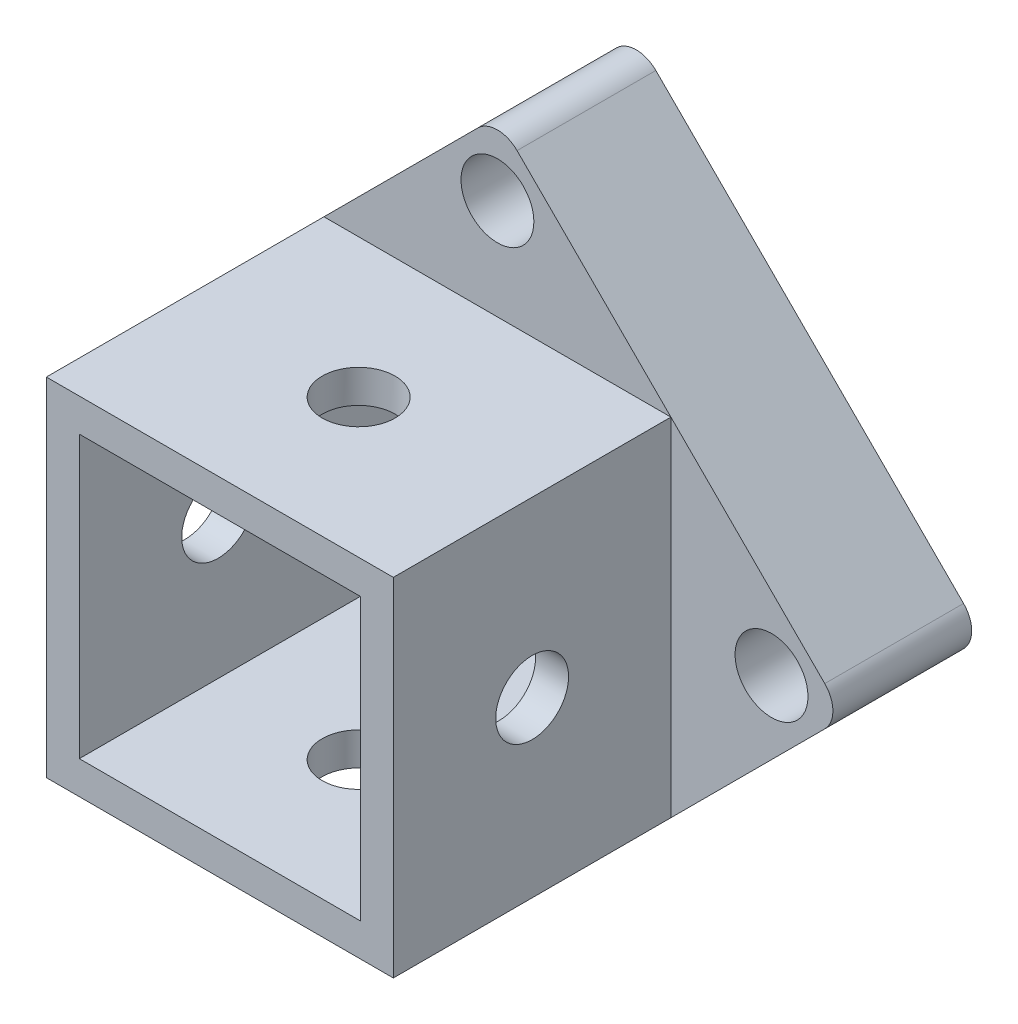
ISO-10303-21;
HEADER;
FILE_DESCRIPTION(('STEP AP214'),'2;1');
FILE_NAME('part.step','',(''),(''),'','','');
FILE_SCHEMA(('AUTOMOTIVE_DESIGN { 1 0 10303 214 1 1 1 1 }'));
ENDSEC;
DATA;
#1=APPLICATION_CONTEXT('core data for automotive mechanical design processes');
#2=APPLICATION_PROTOCOL_DEFINITION('international standard','automotive_design',2000,#1);
#3=PRODUCT_CONTEXT('',#1,'mechanical');
#4=PRODUCT('Part','Part','',(#3));
#5=PRODUCT_RELATED_PRODUCT_CATEGORY('part','',(#4));
#6=PRODUCT_DEFINITION_FORMATION('','',#4);
#7=PRODUCT_DEFINITION_CONTEXT('part definition',#1,'design');
#8=PRODUCT_DEFINITION('design','',#6,#7);
#9=PRODUCT_DEFINITION_SHAPE('','',#8);
#10=(LENGTH_UNIT() NAMED_UNIT(*) SI_UNIT(.MILLI.,.METRE.));
#11=(NAMED_UNIT(*) PLANE_ANGLE_UNIT() SI_UNIT($,.RADIAN.));
#12=(NAMED_UNIT(*) SI_UNIT($,.STERADIAN.) SOLID_ANGLE_UNIT());
#13=UNCERTAINTY_MEASURE_WITH_UNIT(LENGTH_MEASURE(1.E-05),#10,'distance_accuracy_value','');
#14=(GEOMETRIC_REPRESENTATION_CONTEXT(3) GLOBAL_UNCERTAINTY_ASSIGNED_CONTEXT((#13)) GLOBAL_UNIT_ASSIGNED_CONTEXT((#10,
#11,#12)) REPRESENTATION_CONTEXT('',''));
#15=CARTESIAN_POINT('',(0.,0.,0.));
#16=DIRECTION('',(0.,0.,1.));
#17=DIRECTION('',(1.,0.,0.));
#18=AXIS2_PLACEMENT_3D('',#15,#16,#17);
#19=CARTESIAN_POINT('',(0.,0.,5.));
#20=DIRECTION('',(0.,0.,-1.));
#21=DIRECTION('',(-1.,0.,0.));
#22=AXIS2_PLACEMENT_3D('',#19,#20,#21);
#23=PLANE('',#22);
#24=CARTESIAN_POINT('',(19.75,0.,5.));
#25=DIRECTION('',(0.,0.,1.));
#26=DIRECTION('',(1.,0.,0.));
#27=AXIS2_PLACEMENT_3D('',#24,#25,#26);
#28=CIRCLE('',#27,2.625);
#29=CARTESIAN_POINT('',(22.375,0.,5.));
#30=VERTEX_POINT('',#29);
#31=EDGE_CURVE('E259',#30,#30,#28,.T.);
#32=ORIENTED_EDGE('',*,*,#31,.F.);
#33=EDGE_LOOP('',(#32));
#34=FACE_BOUND('',#33,.T.);
#35=DIRECTION('',(0.707106781186547,0.707106781186547,0.));
#36=VECTOR('',#35,1.);
#37=CARTESIAN_POINT('',(25.,0.,5.));
#38=LINE('',#37,#36);
#39=CARTESIAN_POINT('',(12.5,-12.5,5.));
#40=VERTEX_POINT('',#39);
#41=CARTESIAN_POINT('',(23.5857864376269,-1.4142135623731,5.));
#42=VERTEX_POINT('',#41);
#43=EDGE_CURVE('E279',#40,#42,#38,.T.);
#44=ORIENTED_EDGE('',*,*,#43,.T.);
#45=CARTESIAN_POINT('',(22.1715728752538,0.,5.));
#46=DIRECTION('',(0.,0.,-1.));
#47=DIRECTION('',(-1.,0.,0.));
#48=AXIS2_PLACEMENT_3D('',#45,#46,#47);
#49=CIRCLE('',#48,2.);
#50=CARTESIAN_POINT('',(23.5857864376269,1.4142135623731,5.));
#51=VERTEX_POINT('',#50);
#52=EDGE_CURVE('E372',#42,#51,#49,.F.);
#53=ORIENTED_EDGE('',*,*,#52,.T.);
#54=DIRECTION('',(-0.707106781186547,0.707106781186547,0.));
#55=VECTOR('',#54,1.);
#56=CARTESIAN_POINT('',(0.,25.,5.));
#57=LINE('',#56,#55);
#58=CARTESIAN_POINT('',(12.5,12.5,5.));
#59=VERTEX_POINT('',#58);
#60=EDGE_CURVE('E280',#51,#59,#57,.T.);
#61=ORIENTED_EDGE('',*,*,#60,.T.);
#62=DIRECTION('',(0.,1.,0.));
#63=VECTOR('',#62,1.);
#64=CARTESIAN_POINT('',(12.5,-12.5,5.));
#65=LINE('',#64,#63);
#66=EDGE_CURVE('E197',#40,#59,#65,.T.);
#67=ORIENTED_EDGE('',*,*,#66,.F.);
#68=EDGE_LOOP('',(#44,#53,#61,#67));
#69=FACE_BOUND('',#68,.T.);
#70=ADVANCED_FACE('F45',(#34,#69),#23,.F.);
#71=CARTESIAN_POINT('',(0.,-19.7500000000001,5.));
#72=DIRECTION('',(0.,0.,1.));
#73=DIRECTION('',(1.,0.,0.));
#74=AXIS2_PLACEMENT_3D('',#71,#72,#73);
#75=CIRCLE('',#74,2.62500000000005);
#76=CARTESIAN_POINT('',(2.62499999999999,-19.7500000000001,5.));
#77=VERTEX_POINT('',#76);
#78=EDGE_CURVE('E251',#77,#77,#75,.T.);
#79=ORIENTED_EDGE('',*,*,#78,.F.);
#80=EDGE_LOOP('',(#79));
#81=FACE_BOUND('',#80,.T.);
#82=DIRECTION('',(0.707106781186547,-0.707106781186547,0.));
#83=VECTOR('',#82,1.);
#84=CARTESIAN_POINT('',(0.,-25.,5.));
#85=LINE('',#84,#83);
#86=CARTESIAN_POINT('',(-12.5,-12.5,5.));
#87=VERTEX_POINT('',#86);
#88=CARTESIAN_POINT('',(-1.41421356237309,-23.5857864376269,5.));
#89=VERTEX_POINT('',#88);
#90=EDGE_CURVE('E287',#87,#89,#85,.T.);
#91=ORIENTED_EDGE('',*,*,#90,.T.);
#92=CARTESIAN_POINT('',(0.,-22.1715728752538,5.));
#93=DIRECTION('',(0.,0.,-1.));
#94=DIRECTION('',(-1.,0.,0.));
#95=AXIS2_PLACEMENT_3D('',#92,#93,#94);
#96=CIRCLE('',#95,2.);
#97=CARTESIAN_POINT('',(1.4142135623731,-23.5857864376269,5.));
#98=VERTEX_POINT('',#97);
#99=EDGE_CURVE('E362',#89,#98,#96,.F.);
#100=ORIENTED_EDGE('',*,*,#99,.T.);
#101=EDGE_CURVE('E275',#98,#40,#38,.T.);
#102=ORIENTED_EDGE('',*,*,#101,.T.);
#103=DIRECTION('',(1.,0.,0.));
#104=VECTOR('',#103,1.);
#105=CARTESIAN_POINT('',(-12.5,-12.5,5.));
#106=LINE('',#105,#104);
#107=EDGE_CURVE('E203',#87,#40,#106,.T.);
#108=ORIENTED_EDGE('',*,*,#107,.F.);
#109=EDGE_LOOP('',(#91,#100,#102,#108));
#110=FACE_BOUND('',#109,.T.);
#111=ADVANCED_FACE('F430',(#81,#110),#23,.F.);
#112=CARTESIAN_POINT('',(-19.7500000000001,0.,5.));
#113=DIRECTION('',(0.,0.,1.));
#114=DIRECTION('',(1.,0.,0.));
#115=AXIS2_PLACEMENT_3D('',#112,#113,#114);
#116=CIRCLE('',#115,2.62500000000019);
#117=CARTESIAN_POINT('',(-17.1249999999999,0.,5.));
#118=VERTEX_POINT('',#117);
#119=EDGE_CURVE('E243',#118,#118,#116,.T.);
#120=ORIENTED_EDGE('',*,*,#119,.F.);
#121=EDGE_LOOP('',(#120));
#122=FACE_BOUND('',#121,.T.);
#123=DIRECTION('',(-0.707106781186547,-0.707106781186547,0.));
#124=VECTOR('',#123,1.);
#125=CARTESIAN_POINT('',(-25.,0.,5.));
#126=LINE('',#125,#124);
#127=CARTESIAN_POINT('',(-12.5,12.5,5.));
#128=VERTEX_POINT('',#127);
#129=CARTESIAN_POINT('',(-23.5857864376269,1.4142135623731,5.));
#130=VERTEX_POINT('',#129);
#131=EDGE_CURVE('E283',#128,#130,#126,.T.);
#132=ORIENTED_EDGE('',*,*,#131,.T.);
#133=CARTESIAN_POINT('',(-22.1715728752538,0.,5.));
#134=DIRECTION('',(0.,0.,-1.));
#135=DIRECTION('',(-1.,0.,0.));
#136=AXIS2_PLACEMENT_3D('',#133,#134,#135);
#137=CIRCLE('',#136,2.);
#138=CARTESIAN_POINT('',(-23.5857864376269,-1.4142135623731,5.));
#139=VERTEX_POINT('',#138);
#140=EDGE_CURVE('E11',#130,#139,#137,.F.);
#141=ORIENTED_EDGE('',*,*,#140,.T.);
#142=EDGE_CURVE('E288',#139,#87,#85,.T.);
#143=ORIENTED_EDGE('',*,*,#142,.T.);
#144=DIRECTION('',(0.,-1.,0.));
#145=VECTOR('',#144,1.);
#146=CARTESIAN_POINT('',(-12.5,-12.5,5.));
#147=LINE('',#146,#145);
#148=EDGE_CURVE('E220',#128,#87,#147,.T.);
#149=ORIENTED_EDGE('',*,*,#148,.F.);
#150=EDGE_LOOP('',(#132,#141,#143,#149));
#151=FACE_BOUND('',#150,.T.);
#152=ADVANCED_FACE('F441',(#122,#151),#23,.F.);
#153=CARTESIAN_POINT('',(0.,19.75,5.));
#154=DIRECTION('',(0.,0.,1.));
#155=DIRECTION('',(1.,0.,0.));
#156=AXIS2_PLACEMENT_3D('',#153,#154,#155);
#157=CIRCLE('',#156,2.625);
#158=CARTESIAN_POINT('',(2.625,19.75,5.));
#159=VERTEX_POINT('',#158);
#160=EDGE_CURVE('E267',#159,#159,#157,.T.);
#161=ORIENTED_EDGE('',*,*,#160,.F.);
#162=EDGE_LOOP('',(#161));
#163=FACE_BOUND('',#162,.T.);
#164=CARTESIAN_POINT('',(1.41421356237309,23.5857864376269,5.));
#165=VERTEX_POINT('',#164);
#166=EDGE_CURVE('E278',#59,#165,#57,.T.);
#167=ORIENTED_EDGE('',*,*,#166,.T.);
#168=CARTESIAN_POINT('',(0.,22.1715728752538,5.));
#169=DIRECTION('',(0.,0.,-1.));
#170=DIRECTION('',(-1.,0.,0.));
#171=AXIS2_PLACEMENT_3D('',#168,#169,#170);
#172=CIRCLE('',#171,2.);
#173=CARTESIAN_POINT('',(-1.4142135623731,23.5857864376269,5.));
#174=VERTEX_POINT('',#173);
#175=EDGE_CURVE('E54',#165,#174,#172,.F.);
#176=ORIENTED_EDGE('',*,*,#175,.T.);
#177=EDGE_CURVE('E284',#174,#128,#126,.T.);
#178=ORIENTED_EDGE('',*,*,#177,.T.);
#179=DIRECTION('',(-1.,0.,0.));
#180=VECTOR('',#179,1.);
#181=CARTESIAN_POINT('',(-12.5,12.5,5.));
#182=LINE('',#181,#180);
#183=EDGE_CURVE('E216',#59,#128,#182,.T.);
#184=ORIENTED_EDGE('',*,*,#183,.F.);
#185=EDGE_LOOP('',(#167,#176,#178,#184));
#186=FACE_BOUND('',#185,.T.);
#187=ADVANCED_FACE('F414',(#163,#186),#23,.F.);
#188=CARTESIAN_POINT('',(0.,0.,-5.));
#189=DIRECTION('',(0.,0.,-1.));
#190=DIRECTION('',(-1.,0.,0.));
#191=AXIS2_PLACEMENT_3D('',#188,#189,#190);
#192=PLANE('',#191);
#193=DIRECTION('',(0.707106781186547,0.707106781186547,0.));
#194=VECTOR('',#193,1.);
#195=CARTESIAN_POINT('',(25.,0.,-5.));
#196=LINE('',#195,#194);
#197=CARTESIAN_POINT('',(1.4142135623731,-23.5857864376269,-5.));
#198=VERTEX_POINT('',#197);
#199=CARTESIAN_POINT('',(23.5857864376269,-1.4142135623731,-5.));
#200=VERTEX_POINT('',#199);
#201=EDGE_CURVE('E271',#198,#200,#196,.T.);
#202=ORIENTED_EDGE('',*,*,#201,.F.);
#203=CARTESIAN_POINT('',(0.,-22.1715728752538,-5.));
#204=DIRECTION('',(0.,0.,-1.));
#205=DIRECTION('',(-1.,0.,0.));
#206=AXIS2_PLACEMENT_3D('',#203,#204,#205);
#207=CIRCLE('',#206,2.);
#208=CARTESIAN_POINT('',(-1.41421356237309,-23.5857864376269,-5.));
#209=VERTEX_POINT('',#208);
#210=EDGE_CURVE('E352',#198,#209,#207,.T.);
#211=ORIENTED_EDGE('',*,*,#210,.T.);
#212=DIRECTION('',(0.707106781186547,-0.707106781186547,0.));
#213=VECTOR('',#212,1.);
#214=CARTESIAN_POINT('',(0.,-25.,-5.));
#215=LINE('',#214,#213);
#216=CARTESIAN_POINT('',(-23.5857864376269,-1.4142135623731,-5.));
#217=VERTEX_POINT('',#216);
#218=EDGE_CURVE('E302',#217,#209,#215,.T.);
#219=ORIENTED_EDGE('',*,*,#218,.F.);
#220=CARTESIAN_POINT('',(-22.1715728752538,0.,-5.));
#221=DIRECTION('',(0.,0.,-1.));
#222=DIRECTION('',(-1.,0.,0.));
#223=AXIS2_PLACEMENT_3D('',#220,#221,#222);
#224=CIRCLE('',#223,2.);
#225=CARTESIAN_POINT('',(-23.5857864376269,1.4142135623731,-5.));
#226=VERTEX_POINT('',#225);
#227=EDGE_CURVE('E343',#217,#226,#224,.T.);
#228=ORIENTED_EDGE('',*,*,#227,.T.);
#229=DIRECTION('',(-0.707106781186547,-0.707106781186547,0.));
#230=VECTOR('',#229,1.);
#231=CARTESIAN_POINT('',(-25.,0.,-5.));
#232=LINE('',#231,#230);
#233=CARTESIAN_POINT('',(-1.4142135623731,23.5857864376269,-5.));
#234=VERTEX_POINT('',#233);
#235=EDGE_CURVE('E299',#234,#226,#232,.T.);
#236=ORIENTED_EDGE('',*,*,#235,.F.);
#237=CARTESIAN_POINT('',(0.,22.1715728752538,-5.));
#238=DIRECTION('',(0.,0.,-1.));
#239=DIRECTION('',(-1.,0.,0.));
#240=AXIS2_PLACEMENT_3D('',#237,#238,#239);
#241=CIRCLE('',#240,2.);
#242=CARTESIAN_POINT('',(1.41421356237309,23.5857864376269,-5.));
#243=VERTEX_POINT('',#242);
#244=EDGE_CURVE('E346',#234,#243,#241,.T.);
#245=ORIENTED_EDGE('',*,*,#244,.T.);
#246=DIRECTION('',(-0.707106781186547,0.707106781186547,0.));
#247=VECTOR('',#246,1.);
#248=CARTESIAN_POINT('',(0.,25.,-5.));
#249=LINE('',#248,#247);
#250=CARTESIAN_POINT('',(23.5857864376269,1.4142135623731,-5.));
#251=VERTEX_POINT('',#250);
#252=EDGE_CURVE('E295',#251,#243,#249,.T.);
#253=ORIENTED_EDGE('',*,*,#252,.F.);
#254=CARTESIAN_POINT('',(22.1715728752538,0.,-5.));
#255=DIRECTION('',(0.,0.,-1.));
#256=DIRECTION('',(-1.,0.,0.));
#257=AXIS2_PLACEMENT_3D('',#254,#255,#256);
#258=CIRCLE('',#257,2.);
#259=EDGE_CURVE('E349',#251,#200,#258,.T.);
#260=ORIENTED_EDGE('',*,*,#259,.T.);
#261=EDGE_LOOP('',(#202,#211,#219,#228,#236,#245,#253,#260));
#262=FACE_BOUND('',#261,.T.);
#263=DIRECTION('',(1.,0.,0.));
#264=VECTOR('',#263,1.);
#265=CARTESIAN_POINT('',(-10.125,-10.125,-5.));
#266=LINE('',#265,#264);
#267=CARTESIAN_POINT('',(-10.125,-10.125,-5.));
#268=VERTEX_POINT('',#267);
#269=CARTESIAN_POINT('',(10.125,-10.125,-5.));
#270=VERTEX_POINT('',#269);
#271=EDGE_CURVE('E314',#268,#270,#266,.T.);
#272=ORIENTED_EDGE('',*,*,#271,.T.);
#273=DIRECTION('',(0.,1.,0.));
#274=VECTOR('',#273,1.);
#275=CARTESIAN_POINT('',(10.125,-10.125,-5.));
#276=LINE('',#275,#274);
#277=CARTESIAN_POINT('',(10.125,10.125,-5.));
#278=VERTEX_POINT('',#277);
#279=EDGE_CURVE('E291',#270,#278,#276,.T.);
#280=ORIENTED_EDGE('',*,*,#279,.T.);
#281=DIRECTION('',(-1.,0.,0.));
#282=VECTOR('',#281,1.);
#283=CARTESIAN_POINT('',(-10.125,10.125,-5.));
#284=LINE('',#283,#282);
#285=CARTESIAN_POINT('',(-10.125,10.125,-5.));
#286=VERTEX_POINT('',#285);
#287=EDGE_CURVE('E167',#278,#286,#284,.T.);
#288=ORIENTED_EDGE('',*,*,#287,.T.);
#289=DIRECTION('',(0.,-1.,0.));
#290=VECTOR('',#289,1.);
#291=CARTESIAN_POINT('',(-10.125,-10.125,-5.));
#292=LINE('',#291,#290);
#293=EDGE_CURVE('E310',#286,#268,#292,.T.);
#294=ORIENTED_EDGE('',*,*,#293,.T.);
#295=EDGE_LOOP('',(#272,#280,#288,#294));
#296=FACE_BOUND('',#295,.T.);
#297=CARTESIAN_POINT('',(0.,-19.7500000000001,-5.));
#298=DIRECTION('',(0.,0.,1.));
#299=DIRECTION('',(1.,0.,0.));
#300=AXIS2_PLACEMENT_3D('',#297,#298,#299);
#301=CIRCLE('',#300,2.62500000000005);
#302=CARTESIAN_POINT('',(2.62499999999999,-19.7500000000001,-5.));
#303=VERTEX_POINT('',#302);
#304=EDGE_CURVE('E247',#303,#303,#301,.T.);
#305=ORIENTED_EDGE('',*,*,#304,.T.);
#306=EDGE_LOOP('',(#305));
#307=FACE_BOUND('',#306,.T.);
#308=CARTESIAN_POINT('',(-19.7500000000001,0.,-5.));
#309=DIRECTION('',(0.,0.,1.));
#310=DIRECTION('',(1.,0.,0.));
#311=AXIS2_PLACEMENT_3D('',#308,#309,#310);
#312=CIRCLE('',#311,2.62500000000019);
#313=CARTESIAN_POINT('',(-17.1249999999999,0.,-5.));
#314=VERTEX_POINT('',#313);
#315=EDGE_CURVE('E242',#314,#314,#312,.T.);
#316=ORIENTED_EDGE('',*,*,#315,.T.);
#317=EDGE_LOOP('',(#316));
#318=FACE_BOUND('',#317,.T.);
#319=CARTESIAN_POINT('',(0.,19.75,-5.));
#320=DIRECTION('',(0.,0.,1.));
#321=DIRECTION('',(1.,0.,0.));
#322=AXIS2_PLACEMENT_3D('',#319,#320,#321);
#323=CIRCLE('',#322,2.625);
#324=CARTESIAN_POINT('',(2.625,19.75,-5.));
#325=VERTEX_POINT('',#324);
#326=EDGE_CURVE('E263',#325,#325,#323,.T.);
#327=ORIENTED_EDGE('',*,*,#326,.T.);
#328=EDGE_LOOP('',(#327));
#329=FACE_BOUND('',#328,.T.);
#330=CARTESIAN_POINT('',(19.75,0.,-5.));
#331=DIRECTION('',(0.,0.,1.));
#332=DIRECTION('',(1.,0.,0.));
#333=AXIS2_PLACEMENT_3D('',#330,#331,#332);
#334=CIRCLE('',#333,2.625);
#335=CARTESIAN_POINT('',(22.375,0.,-5.));
#336=VERTEX_POINT('',#335);
#337=EDGE_CURVE('E255',#336,#336,#334,.T.);
#338=ORIENTED_EDGE('',*,*,#337,.T.);
#339=EDGE_LOOP('',(#338));
#340=FACE_BOUND('',#339,.T.);
#341=ADVANCED_FACE('F405',(#262,#296,#307,#318,#329,#340),#192,.T.);
#342=CARTESIAN_POINT('',(10.125,-10.125,5.));
#343=DIRECTION('',(-1.,0.,0.));
#344=DIRECTION('',(0.,0.,1.));
#345=AXIS2_PLACEMENT_3D('',#342,#343,#344);
#346=PLANE('',#345);
#347=CARTESIAN_POINT('',(10.125,0.,15.));
#348=DIRECTION('',(-1.,0.,0.));
#349=DIRECTION('',(0.,0.,1.));
#350=AXIS2_PLACEMENT_3D('',#347,#348,#349);
#351=CIRCLE('',#350,2.625);
#352=CARTESIAN_POINT('',(10.125,0.,17.625));
#353=VERTEX_POINT('',#352);
#354=EDGE_CURVE('E522',#353,#353,#351,.T.);
#355=ORIENTED_EDGE('',*,*,#354,.F.);
#356=EDGE_LOOP('',(#355));
#357=FACE_BOUND('',#356,.T.);
#358=ORIENTED_EDGE('',*,*,#279,.F.);
#359=DIRECTION('',(0.,0.,-1.));
#360=VECTOR('',#359,1.);
#361=CARTESIAN_POINT('',(10.125,-10.125,5.));
#362=LINE('',#361,#360);
#363=CARTESIAN_POINT('',(10.125,-10.125,25.));
#364=VERTEX_POINT('',#363);
#365=EDGE_CURVE('E178',#364,#270,#362,.T.);
#366=ORIENTED_EDGE('',*,*,#365,.F.);
#367=DIRECTION('',(0.,1.,0.));
#368=VECTOR('',#367,1.);
#369=CARTESIAN_POINT('',(10.125,-10.125,25.));
#370=LINE('',#369,#368);
#371=CARTESIAN_POINT('',(10.125,10.125,25.));
#372=VERTEX_POINT('',#371);
#373=EDGE_CURVE('E175',#364,#372,#370,.T.);
#374=ORIENTED_EDGE('',*,*,#373,.T.);
#375=DIRECTION('',(0.,0.,-1.));
#376=VECTOR('',#375,1.);
#377=CARTESIAN_POINT('',(10.125,10.125,5.));
#378=LINE('',#377,#376);
#379=EDGE_CURVE('E160',#372,#278,#378,.T.);
#380=ORIENTED_EDGE('',*,*,#379,.T.);
#381=EDGE_LOOP('',(#358,#366,#374,#380));
#382=FACE_BOUND('',#381,.T.);
#383=ADVANCED_FACE('F176',(#357,#382),#346,.T.);
#384=CARTESIAN_POINT('',(-10.125,10.125,5.));
#385=DIRECTION('',(0.,-1.,0.));
#386=DIRECTION('',(0.,0.,-1.));
#387=AXIS2_PLACEMENT_3D('',#384,#385,#386);
#388=PLANE('',#387);
#389=CARTESIAN_POINT('',(0.,10.125,15.));
#390=DIRECTION('',(0.,-1.,0.));
#391=DIRECTION('',(0.,0.,-1.));
#392=AXIS2_PLACEMENT_3D('',#389,#390,#391);
#393=CIRCLE('',#392,2.625);
#394=CARTESIAN_POINT('',(0.,10.125,12.375));
#395=VERTEX_POINT('',#394);
#396=EDGE_CURVE('E183',#395,#395,#393,.T.);
#397=ORIENTED_EDGE('',*,*,#396,.F.);
#398=EDGE_LOOP('',(#397));
#399=FACE_BOUND('',#398,.T.);
#400=ORIENTED_EDGE('',*,*,#287,.F.);
#401=ORIENTED_EDGE('',*,*,#379,.F.);
#402=DIRECTION('',(-1.,0.,0.));
#403=VECTOR('',#402,1.);
#404=CARTESIAN_POINT('',(-10.125,10.125,25.));
#405=LINE('',#404,#403);
#406=CARTESIAN_POINT('',(-10.125,10.125,25.));
#407=VERTEX_POINT('',#406);
#408=EDGE_CURVE('E164',#372,#407,#405,.T.);
#409=ORIENTED_EDGE('',*,*,#408,.T.);
#410=DIRECTION('',(0.,0.,-1.));
#411=VECTOR('',#410,1.);
#412=CARTESIAN_POINT('',(-10.125,10.125,5.));
#413=LINE('',#412,#411);
#414=EDGE_CURVE('E172',#407,#286,#413,.T.);
#415=ORIENTED_EDGE('',*,*,#414,.T.);
#416=EDGE_LOOP('',(#400,#401,#409,#415));
#417=FACE_BOUND('',#416,.T.);
#418=ADVANCED_FACE('F162',(#399,#417),#388,.T.);
#419=CARTESIAN_POINT('',(-10.125,-10.125,5.));
#420=DIRECTION('',(1.,0.,0.));
#421=DIRECTION('',(0.,0.,-1.));
#422=AXIS2_PLACEMENT_3D('',#419,#420,#421);
#423=PLANE('',#422);
#424=CARTESIAN_POINT('',(-10.125,0.,15.));
#425=DIRECTION('',(1.,0.,0.));
#426=DIRECTION('',(0.,0.,-1.));
#427=AXIS2_PLACEMENT_3D('',#424,#425,#426);
#428=CIRCLE('',#427,2.625);
#429=CARTESIAN_POINT('',(-10.125,0.,12.375));
#430=VERTEX_POINT('',#429);
#431=EDGE_CURVE('E335',#430,#430,#428,.T.);
#432=ORIENTED_EDGE('',*,*,#431,.F.);
#433=EDGE_LOOP('',(#432));
#434=FACE_BOUND('',#433,.T.);
#435=ORIENTED_EDGE('',*,*,#293,.F.);
#436=ORIENTED_EDGE('',*,*,#414,.F.);
#437=DIRECTION('',(0.,-1.,0.));
#438=VECTOR('',#437,1.);
#439=CARTESIAN_POINT('',(-10.125,-10.125,25.));
#440=LINE('',#439,#438);
#441=CARTESIAN_POINT('',(-10.125,-10.125,25.));
#442=VERTEX_POINT('',#441);
#443=EDGE_CURVE('E187',#407,#442,#440,.T.);
#444=ORIENTED_EDGE('',*,*,#443,.T.);
#445=DIRECTION('',(0.,0.,-1.));
#446=VECTOR('',#445,1.);
#447=CARTESIAN_POINT('',(-10.125,-10.125,5.));
#448=LINE('',#447,#446);
#449=EDGE_CURVE('E320',#442,#268,#448,.T.);
#450=ORIENTED_EDGE('',*,*,#449,.T.);
#451=EDGE_LOOP('',(#435,#436,#444,#450));
#452=FACE_BOUND('',#451,.T.);
#453=ADVANCED_FACE('F504',(#434,#452),#423,.T.);
#454=CARTESIAN_POINT('',(-10.125,-10.125,5.));
#455=DIRECTION('',(0.,1.,0.));
#456=DIRECTION('',(0.,0.,1.));
#457=AXIS2_PLACEMENT_3D('',#454,#455,#456);
#458=PLANE('',#457);
#459=CARTESIAN_POINT('',(0.,-10.125,15.));
#460=DIRECTION('',(0.,1.,0.));
#461=DIRECTION('',(0.,0.,1.));
#462=AXIS2_PLACEMENT_3D('',#459,#460,#461);
#463=CIRCLE('',#462,2.625);
#464=CARTESIAN_POINT('',(0.,-10.125,17.625));
#465=VERTEX_POINT('',#464);
#466=EDGE_CURVE('E329',#465,#465,#463,.T.);
#467=ORIENTED_EDGE('',*,*,#466,.F.);
#468=EDGE_LOOP('',(#467));
#469=FACE_BOUND('',#468,.T.);
#470=ORIENTED_EDGE('',*,*,#271,.F.);
#471=ORIENTED_EDGE('',*,*,#449,.F.);
#472=DIRECTION('',(1.,0.,0.));
#473=VECTOR('',#472,1.);
#474=CARTESIAN_POINT('',(-10.125,-10.125,25.));
#475=LINE('',#474,#473);
#476=EDGE_CURVE('E191',#442,#364,#475,.T.);
#477=ORIENTED_EDGE('',*,*,#476,.T.);
#478=ORIENTED_EDGE('',*,*,#365,.T.);
#479=EDGE_LOOP('',(#470,#471,#477,#478));
#480=FACE_BOUND('',#479,.T.);
#481=ADVANCED_FACE('F500',(#469,#480),#458,.T.);
#482=CARTESIAN_POINT('',(0.,25.,5.));
#483=DIRECTION('',(-0.707106781186548,-0.707106781186548,0.));
#484=DIRECTION('',(0.707106781186548,-0.707106781186548,0.));
#485=AXIS2_PLACEMENT_3D('',#482,#483,#484);
#486=PLANE('',#485);
#487=ORIENTED_EDGE('',*,*,#60,.F.);
#488=DIRECTION('',(0.,0.,-1.));
#489=VECTOR('',#488,1.);
#490=CARTESIAN_POINT('',(23.5857864376269,1.4142135623731,5.));
#491=LINE('',#490,#489);
#492=EDGE_CURVE('E368',#51,#251,#491,.T.);
#493=ORIENTED_EDGE('',*,*,#492,.T.);
#494=ORIENTED_EDGE('',*,*,#252,.T.);
#495=DIRECTION('',(0.,0.,-1.));
#496=VECTOR('',#495,1.);
#497=CARTESIAN_POINT('',(1.41421356237309,23.5857864376269,5.));
#498=LINE('',#497,#496);
#499=EDGE_CURVE('E365',#243,#165,#498,.F.);
#500=ORIENTED_EDGE('',*,*,#499,.T.);
#501=ORIENTED_EDGE('',*,*,#166,.F.);
#502=EDGE_LOOP('',(#487,#493,#494,#500,#501));
#503=FACE_BOUND('',#502,.T.);
#504=ADVANCED_FACE('F400',(#503),#486,.F.);
#505=CARTESIAN_POINT('',(-25.,0.,5.));
#506=DIRECTION('',(0.707106781186548,-0.707106781186548,0.));
#507=DIRECTION('',(0.707106781186548,0.707106781186548,0.));
#508=AXIS2_PLACEMENT_3D('',#505,#506,#507);
#509=PLANE('',#508);
#510=ORIENTED_EDGE('',*,*,#177,.F.);
#511=DIRECTION('',(0.,0.,-1.));
#512=VECTOR('',#511,1.);
#513=CARTESIAN_POINT('',(-1.41421356237309,23.5857864376269,5.));
#514=LINE('',#513,#512);
#515=EDGE_CURVE('E377',#174,#234,#514,.T.);
#516=ORIENTED_EDGE('',*,*,#515,.T.);
#517=ORIENTED_EDGE('',*,*,#235,.T.);
#518=DIRECTION('',(0.,0.,-1.));
#519=VECTOR('',#518,1.);
#520=CARTESIAN_POINT('',(-23.5857864376269,1.4142135623731,5.));
#521=LINE('',#520,#519);
#522=EDGE_CURVE('E68',#226,#130,#521,.F.);
#523=ORIENTED_EDGE('',*,*,#522,.T.);
#524=ORIENTED_EDGE('',*,*,#131,.F.);
#525=EDGE_LOOP('',(#510,#516,#517,#523,#524));
#526=FACE_BOUND('',#525,.T.);
#527=ADVANCED_FACE('F411',(#526),#509,.F.);
#528=CARTESIAN_POINT('',(25.,0.,5.));
#529=DIRECTION('',(-0.707106781186548,0.707106781186548,0.));
#530=DIRECTION('',(-0.707106781186548,-0.707106781186548,0.));
#531=AXIS2_PLACEMENT_3D('',#528,#529,#530);
#532=PLANE('',#531);
#533=ORIENTED_EDGE('',*,*,#101,.F.);
#534=DIRECTION('',(0.,0.,-1.));
#535=VECTOR('',#534,1.);
#536=CARTESIAN_POINT('',(1.41421356237309,-23.5857864376269,5.));
#537=LINE('',#536,#535);
#538=EDGE_CURVE('E339',#98,#198,#537,.T.);
#539=ORIENTED_EDGE('',*,*,#538,.T.);
#540=ORIENTED_EDGE('',*,*,#201,.T.);
#541=DIRECTION('',(0.,0.,-1.));
#542=VECTOR('',#541,1.);
#543=CARTESIAN_POINT('',(23.5857864376269,-1.4142135623731,5.));
#544=LINE('',#543,#542);
#545=EDGE_CURVE('E171',#200,#42,#544,.F.);
#546=ORIENTED_EDGE('',*,*,#545,.T.);
#547=ORIENTED_EDGE('',*,*,#43,.F.);
#548=EDGE_LOOP('',(#533,#539,#540,#546,#547));
#549=FACE_BOUND('',#548,.T.);
#550=ADVANCED_FACE('F448',(#549),#532,.F.);
#551=CARTESIAN_POINT('',(0.,-25.,5.));
#552=DIRECTION('',(0.707106781186548,0.707106781186548,0.));
#553=DIRECTION('',(-0.707106781186548,0.707106781186548,0.));
#554=AXIS2_PLACEMENT_3D('',#551,#552,#553);
#555=PLANE('',#554);
#556=ORIENTED_EDGE('',*,*,#218,.T.);
#557=DIRECTION('',(0.,0.,-1.));
#558=VECTOR('',#557,1.);
#559=CARTESIAN_POINT('',(-1.41421356237309,-23.5857864376269,5.));
#560=LINE('',#559,#558);
#561=EDGE_CURVE('E359',#209,#89,#560,.F.);
#562=ORIENTED_EDGE('',*,*,#561,.T.);
#563=ORIENTED_EDGE('',*,*,#90,.F.);
#564=ORIENTED_EDGE('',*,*,#142,.F.);
#565=DIRECTION('',(0.,0.,-1.));
#566=VECTOR('',#565,1.);
#567=CARTESIAN_POINT('',(-23.5857864376269,-1.4142135623731,5.));
#568=LINE('',#567,#566);
#569=EDGE_CURVE('E355',#139,#217,#568,.T.);
#570=ORIENTED_EDGE('',*,*,#569,.T.);
#571=EDGE_LOOP('',(#556,#562,#563,#564,#570));
#572=FACE_BOUND('',#571,.T.);
#573=ADVANCED_FACE('F434',(#572),#555,.F.);
#574=CARTESIAN_POINT('',(0.,19.75,5.));
#575=DIRECTION('',(0.,0.,-1.));
#576=DIRECTION('',(-1.,0.,0.));
#577=AXIS2_PLACEMENT_3D('',#574,#575,#576);
#578=CYLINDRICAL_SURFACE('',#577,2.625);
#579=ORIENTED_EDGE('',*,*,#160,.T.);
#580=EDGE_LOOP('',(#579));
#581=FACE_BOUND('',#580,.T.);
#582=ORIENTED_EDGE('',*,*,#326,.F.);
#583=EDGE_LOOP('',(#582));
#584=FACE_BOUND('',#583,.T.);
#585=ADVANCED_FACE('F455',(#581,#584),#578,.F.);
#586=CARTESIAN_POINT('',(19.75,0.,5.));
#587=DIRECTION('',(0.,0.,-1.));
#588=DIRECTION('',(-1.,0.,0.));
#589=AXIS2_PLACEMENT_3D('',#586,#587,#588);
#590=CYLINDRICAL_SURFACE('',#589,2.625);
#591=ORIENTED_EDGE('',*,*,#31,.T.);
#592=EDGE_LOOP('',(#591));
#593=FACE_BOUND('',#592,.T.);
#594=ORIENTED_EDGE('',*,*,#337,.F.);
#595=EDGE_LOOP('',(#594));
#596=FACE_BOUND('',#595,.T.);
#597=ADVANCED_FACE('F481',(#593,#596),#590,.F.);
#598=CARTESIAN_POINT('',(0.,-19.7500000000001,5.));
#599=DIRECTION('',(0.,0.,-1.));
#600=DIRECTION('',(-1.,0.,0.));
#601=AXIS2_PLACEMENT_3D('',#598,#599,#600);
#602=CYLINDRICAL_SURFACE('',#601,2.62500000000005);
#603=ORIENTED_EDGE('',*,*,#78,.T.);
#604=EDGE_LOOP('',(#603));
#605=FACE_BOUND('',#604,.T.);
#606=ORIENTED_EDGE('',*,*,#304,.F.);
#607=EDGE_LOOP('',(#606));
#608=FACE_BOUND('',#607,.T.);
#609=ADVANCED_FACE('F489',(#605,#608),#602,.F.);
#610=CARTESIAN_POINT('',(-19.7500000000001,0.,5.));
#611=DIRECTION('',(0.,0.,-1.));
#612=DIRECTION('',(-1.,0.,0.));
#613=AXIS2_PLACEMENT_3D('',#610,#611,#612);
#614=CYLINDRICAL_SURFACE('',#613,2.62500000000019);
#615=ORIENTED_EDGE('',*,*,#119,.T.);
#616=EDGE_LOOP('',(#615));
#617=FACE_BOUND('',#616,.T.);
#618=ORIENTED_EDGE('',*,*,#315,.F.);
#619=EDGE_LOOP('',(#618));
#620=FACE_BOUND('',#619,.T.);
#621=ADVANCED_FACE('F495',(#617,#620),#614,.F.);
#622=CARTESIAN_POINT('',(0.,0.,25.));
#623=DIRECTION('',(0.,0.,-1.));
#624=DIRECTION('',(-1.,0.,0.));
#625=AXIS2_PLACEMENT_3D('',#622,#623,#624);
#626=PLANE('',#625);
#627=DIRECTION('',(0.,1.,0.));
#628=VECTOR('',#627,1.);
#629=CARTESIAN_POINT('',(12.5,-12.5,25.));
#630=LINE('',#629,#628);
#631=CARTESIAN_POINT('',(12.5,-12.5,25.));
#632=VERTEX_POINT('',#631);
#633=CARTESIAN_POINT('',(12.5,12.5,25.));
#634=VERTEX_POINT('',#633);
#635=EDGE_CURVE('E198',#632,#634,#630,.T.);
#636=ORIENTED_EDGE('',*,*,#635,.T.);
#637=DIRECTION('',(-1.,0.,0.));
#638=VECTOR('',#637,1.);
#639=CARTESIAN_POINT('',(-12.5,12.5,25.));
#640=LINE('',#639,#638);
#641=CARTESIAN_POINT('',(-12.5,12.5,25.));
#642=VERTEX_POINT('',#641);
#643=EDGE_CURVE('E202',#634,#642,#640,.T.);
#644=ORIENTED_EDGE('',*,*,#643,.T.);
#645=DIRECTION('',(0.,-1.,0.));
#646=VECTOR('',#645,1.);
#647=CARTESIAN_POINT('',(-12.5,-12.5,25.));
#648=LINE('',#647,#646);
#649=CARTESIAN_POINT('',(-12.5,-12.5,25.));
#650=VERTEX_POINT('',#649);
#651=EDGE_CURVE('E206',#642,#650,#648,.T.);
#652=ORIENTED_EDGE('',*,*,#651,.T.);
#653=DIRECTION('',(1.,0.,0.));
#654=VECTOR('',#653,1.);
#655=CARTESIAN_POINT('',(-12.5,-12.5,25.));
#656=LINE('',#655,#654);
#657=EDGE_CURVE('E209',#650,#632,#656,.T.);
#658=ORIENTED_EDGE('',*,*,#657,.T.);
#659=EDGE_LOOP('',(#636,#644,#652,#658));
#660=FACE_BOUND('',#659,.T.);
#661=ORIENTED_EDGE('',*,*,#373,.F.);
#662=ORIENTED_EDGE('',*,*,#476,.F.);
#663=ORIENTED_EDGE('',*,*,#443,.F.);
#664=ORIENTED_EDGE('',*,*,#408,.F.);
#665=EDGE_LOOP('',(#661,#662,#663,#664));
#666=FACE_BOUND('',#665,.T.);
#667=ADVANCED_FACE('F185',(#660,#666),#626,.F.);
#668=CARTESIAN_POINT('',(12.5,-12.5,25.));
#669=DIRECTION('',(-1.,0.,0.));
#670=DIRECTION('',(0.,0.,1.));
#671=AXIS2_PLACEMENT_3D('',#668,#669,#670);
#672=PLANE('',#671);
#673=CARTESIAN_POINT('',(12.5,0.,15.));
#674=DIRECTION('',(1.,0.,0.));
#675=DIRECTION('',(0.,0.,-1.));
#676=AXIS2_PLACEMENT_3D('',#673,#674,#675);
#677=CIRCLE('',#676,2.625);
#678=CARTESIAN_POINT('',(12.5,0.,12.375));
#679=VERTEX_POINT('',#678);
#680=EDGE_CURVE('E336',#679,#679,#677,.T.);
#681=ORIENTED_EDGE('',*,*,#680,.F.);
#682=EDGE_LOOP('',(#681));
#683=FACE_BOUND('',#682,.T.);
#684=ORIENTED_EDGE('',*,*,#66,.T.);
#685=DIRECTION('',(0.,0.,-1.));
#686=VECTOR('',#685,1.);
#687=CARTESIAN_POINT('',(12.5,12.5,25.));
#688=LINE('',#687,#686);
#689=EDGE_CURVE('E238',#634,#59,#688,.T.);
#690=ORIENTED_EDGE('',*,*,#689,.F.);
#691=ORIENTED_EDGE('',*,*,#635,.F.);
#692=DIRECTION('',(0.,0.,-1.));
#693=VECTOR('',#692,1.);
#694=CARTESIAN_POINT('',(12.5,-12.5,25.));
#695=LINE('',#694,#693);
#696=EDGE_CURVE('E212',#632,#40,#695,.T.);
#697=ORIENTED_EDGE('',*,*,#696,.T.);
#698=EDGE_LOOP('',(#684,#690,#691,#697));
#699=FACE_BOUND('',#698,.T.);
#700=ADVANCED_FACE('F421',(#683,#699),#672,.F.);
#701=CARTESIAN_POINT('',(-12.5,12.5,25.));
#702=DIRECTION('',(0.,-1.,0.));
#703=DIRECTION('',(0.,0.,-1.));
#704=AXIS2_PLACEMENT_3D('',#701,#702,#703);
#705=PLANE('',#704);
#706=CARTESIAN_POINT('',(0.,12.5,15.));
#707=DIRECTION('',(0.,1.,0.));
#708=DIRECTION('',(0.,0.,1.));
#709=AXIS2_PLACEMENT_3D('',#706,#707,#708);
#710=CIRCLE('',#709,2.625);
#711=CARTESIAN_POINT('',(0.,12.5,17.625));
#712=VERTEX_POINT('',#711);
#713=EDGE_CURVE('E330',#712,#712,#710,.T.);
#714=ORIENTED_EDGE('',*,*,#713,.F.);
#715=EDGE_LOOP('',(#714));
#716=FACE_BOUND('',#715,.T.);
#717=ORIENTED_EDGE('',*,*,#183,.T.);
#718=DIRECTION('',(0.,0.,-1.));
#719=VECTOR('',#718,1.);
#720=CARTESIAN_POINT('',(-12.5,12.5,25.));
#721=LINE('',#720,#719);
#722=EDGE_CURVE('E234',#642,#128,#721,.T.);
#723=ORIENTED_EDGE('',*,*,#722,.F.);
#724=ORIENTED_EDGE('',*,*,#643,.F.);
#725=ORIENTED_EDGE('',*,*,#689,.T.);
#726=EDGE_LOOP('',(#717,#723,#724,#725));
#727=FACE_BOUND('',#726,.T.);
#728=ADVANCED_FACE('F418',(#716,#727),#705,.F.);
#729=CARTESIAN_POINT('',(-12.5,-12.5,25.));
#730=DIRECTION('',(1.,0.,0.));
#731=DIRECTION('',(0.,0.,-1.));
#732=AXIS2_PLACEMENT_3D('',#729,#730,#731);
#733=PLANE('',#732);
#734=CARTESIAN_POINT('',(-12.5,0.,15.));
#735=DIRECTION('',(1.,0.,0.));
#736=DIRECTION('',(0.,0.,-1.));
#737=AXIS2_PLACEMENT_3D('',#734,#735,#736);
#738=CIRCLE('',#737,2.625);
#739=CARTESIAN_POINT('',(-12.5,0.,12.375));
#740=VERTEX_POINT('',#739);
#741=EDGE_CURVE('E331',#740,#740,#738,.T.);
#742=ORIENTED_EDGE('',*,*,#741,.T.);
#743=EDGE_LOOP('',(#742));
#744=FACE_BOUND('',#743,.T.);
#745=ORIENTED_EDGE('',*,*,#148,.T.);
#746=DIRECTION('',(0.,0.,-1.));
#747=VECTOR('',#746,1.);
#748=CARTESIAN_POINT('',(-12.5,-12.5,25.));
#749=LINE('',#748,#747);
#750=EDGE_CURVE('E230',#650,#87,#749,.T.);
#751=ORIENTED_EDGE('',*,*,#750,.F.);
#752=ORIENTED_EDGE('',*,*,#651,.F.);
#753=ORIENTED_EDGE('',*,*,#722,.T.);
#754=EDGE_LOOP('',(#745,#751,#752,#753));
#755=FACE_BOUND('',#754,.T.);
#756=ADVANCED_FACE('F438',(#744,#755),#733,.F.);
#757=CARTESIAN_POINT('',(-12.5,-12.5,25.));
#758=DIRECTION('',(0.,1.,0.));
#759=DIRECTION('',(0.,0.,1.));
#760=AXIS2_PLACEMENT_3D('',#757,#758,#759);
#761=PLANE('',#760);
#762=CARTESIAN_POINT('',(0.,-12.5,15.));
#763=DIRECTION('',(0.,1.,0.));
#764=DIRECTION('',(0.,0.,1.));
#765=AXIS2_PLACEMENT_3D('',#762,#763,#764);
#766=CIRCLE('',#765,2.625);
#767=CARTESIAN_POINT('',(0.,-12.5,17.625));
#768=VERTEX_POINT('',#767);
#769=EDGE_CURVE('E325',#768,#768,#766,.T.);
#770=ORIENTED_EDGE('',*,*,#769,.T.);
#771=EDGE_LOOP('',(#770));
#772=FACE_BOUND('',#771,.T.);
#773=ORIENTED_EDGE('',*,*,#107,.T.);
#774=ORIENTED_EDGE('',*,*,#696,.F.);
#775=ORIENTED_EDGE('',*,*,#657,.F.);
#776=ORIENTED_EDGE('',*,*,#750,.T.);
#777=EDGE_LOOP('',(#773,#774,#775,#776));
#778=FACE_BOUND('',#777,.T.);
#779=ADVANCED_FACE('F425',(#772,#778),#761,.F.);
#780=CARTESIAN_POINT('',(0.,-25.,15.));
#781=DIRECTION('',(0.,1.,0.));
#782=DIRECTION('',(0.,0.,1.));
#783=AXIS2_PLACEMENT_3D('',#780,#781,#782);
#784=CYLINDRICAL_SURFACE('',#783,2.625);
#785=ORIENTED_EDGE('',*,*,#466,.T.);
#786=EDGE_LOOP('',(#785));
#787=FACE_BOUND('',#786,.T.);
#788=ORIENTED_EDGE('',*,*,#769,.F.);
#789=EDGE_LOOP('',(#788));
#790=FACE_BOUND('',#789,.T.);
#791=ADVANCED_FACE('F544',(#787,#790),#784,.F.);
#792=ORIENTED_EDGE('',*,*,#396,.T.);
#793=EDGE_LOOP('',(#792));
#794=FACE_BOUND('',#793,.T.);
#795=ORIENTED_EDGE('',*,*,#713,.T.);
#796=EDGE_LOOP('',(#795));
#797=FACE_BOUND('',#796,.T.);
#798=ADVANCED_FACE('F540',(#794,#797),#784,.F.);
#799=CARTESIAN_POINT('',(-25.,0.,15.));
#800=DIRECTION('',(1.,0.,0.));
#801=DIRECTION('',(0.,0.,-1.));
#802=AXIS2_PLACEMENT_3D('',#799,#800,#801);
#803=CYLINDRICAL_SURFACE('',#802,2.625);
#804=ORIENTED_EDGE('',*,*,#431,.T.);
#805=EDGE_LOOP('',(#804));
#806=FACE_BOUND('',#805,.T.);
#807=ORIENTED_EDGE('',*,*,#741,.F.);
#808=EDGE_LOOP('',(#807));
#809=FACE_BOUND('',#808,.T.);
#810=ADVANCED_FACE('F543',(#806,#809),#803,.F.);
#811=ORIENTED_EDGE('',*,*,#354,.T.);
#812=EDGE_LOOP('',(#811));
#813=FACE_BOUND('',#812,.T.);
#814=ORIENTED_EDGE('',*,*,#680,.T.);
#815=EDGE_LOOP('',(#814));
#816=FACE_BOUND('',#815,.T.);
#817=ADVANCED_FACE('F593',(#813,#816),#803,.F.);
#818=CARTESIAN_POINT('',(0.,-22.1715728752538,5.));
#819=DIRECTION('',(0.,0.,-1.));
#820=DIRECTION('',(-1.,0.,0.));
#821=AXIS2_PLACEMENT_3D('',#818,#819,#820);
#822=CYLINDRICAL_SURFACE('',#821,2.);
#823=ORIENTED_EDGE('',*,*,#99,.F.);
#824=ORIENTED_EDGE('',*,*,#561,.F.);
#825=ORIENTED_EDGE('',*,*,#210,.F.);
#826=ORIENTED_EDGE('',*,*,#538,.F.);
#827=EDGE_LOOP('',(#823,#824,#825,#826));
#828=FACE_BOUND('',#827,.T.);
#829=ADVANCED_FACE('F447',(#828),#822,.T.);
#830=CARTESIAN_POINT('',(22.1715728752538,0.,5.));
#831=DIRECTION('',(0.,0.,-1.));
#832=DIRECTION('',(-1.,0.,0.));
#833=AXIS2_PLACEMENT_3D('',#830,#831,#832);
#834=CYLINDRICAL_SURFACE('',#833,2.);
#835=ORIENTED_EDGE('',*,*,#52,.F.);
#836=ORIENTED_EDGE('',*,*,#545,.F.);
#837=ORIENTED_EDGE('',*,*,#259,.F.);
#838=ORIENTED_EDGE('',*,*,#492,.F.);
#839=EDGE_LOOP('',(#835,#836,#837,#838));
#840=FACE_BOUND('',#839,.T.);
#841=ADVANCED_FACE('F397',(#840),#834,.T.);
#842=CARTESIAN_POINT('',(0.,22.1715728752538,5.));
#843=DIRECTION('',(0.,0.,-1.));
#844=DIRECTION('',(-1.,0.,0.));
#845=AXIS2_PLACEMENT_3D('',#842,#843,#844);
#846=CYLINDRICAL_SURFACE('',#845,2.);
#847=ORIENTED_EDGE('',*,*,#175,.F.);
#848=ORIENTED_EDGE('',*,*,#499,.F.);
#849=ORIENTED_EDGE('',*,*,#244,.F.);
#850=ORIENTED_EDGE('',*,*,#515,.F.);
#851=EDGE_LOOP('',(#847,#848,#849,#850));
#852=FACE_BOUND('',#851,.T.);
#853=ADVANCED_FACE('F410',(#852),#846,.T.);
#854=CARTESIAN_POINT('',(-22.1715728752538,0.,5.));
#855=DIRECTION('',(0.,0.,-1.));
#856=DIRECTION('',(-1.,0.,0.));
#857=AXIS2_PLACEMENT_3D('',#854,#855,#856);
#858=CYLINDRICAL_SURFACE('',#857,2.);
#859=ORIENTED_EDGE('',*,*,#140,.F.);
#860=ORIENTED_EDGE('',*,*,#522,.F.);
#861=ORIENTED_EDGE('',*,*,#227,.F.);
#862=ORIENTED_EDGE('',*,*,#569,.F.);
#863=EDGE_LOOP('',(#859,#860,#861,#862));
#864=FACE_BOUND('',#863,.T.);
#865=ADVANCED_FACE('F47',(#864),#858,.T.);
#866=CLOSED_SHELL('',(#70,#111,#152,#187,#341,#383,#418,#453,#481,#504,#527,#550,#573,#585,#597,
#609,#621,#667,#700,#728,#756,#779,#791,#798,#810,#817,#829,#841,#853,#865));
#867=MANIFOLD_SOLID_BREP('B2',#866);
#868=ADVANCED_BREP_SHAPE_REPRESENTATION('',(#18,#867),#14);
#869=SHAPE_DEFINITION_REPRESENTATION(#9,#868);
ENDSEC;
END-ISO-10303-21;
